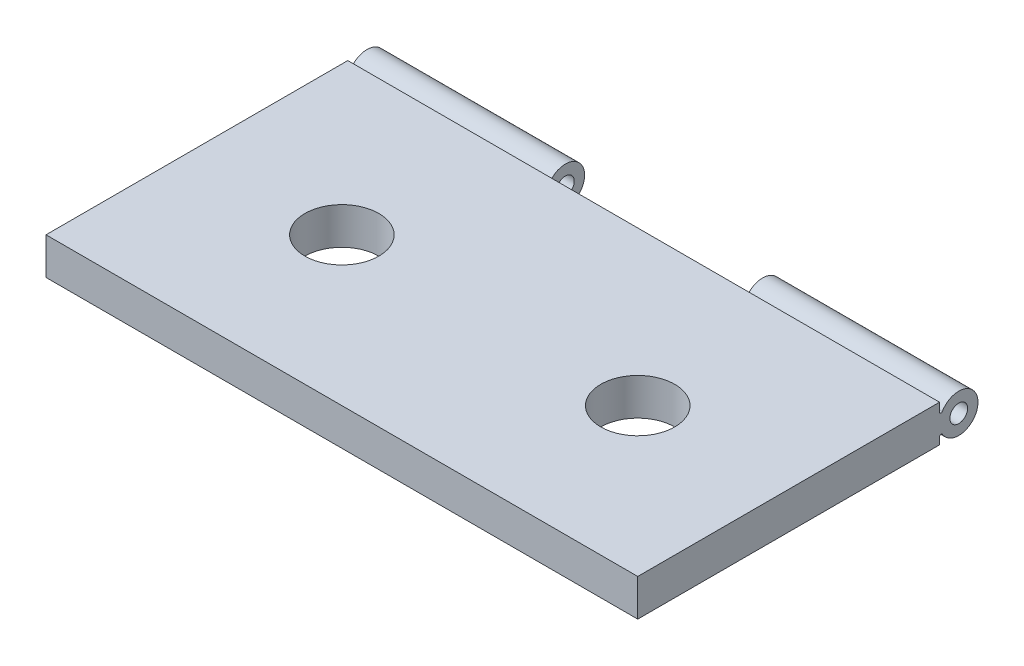
ISO-10303-21;
HEADER;
FILE_DESCRIPTION(('STEP AP214'),'2;1');
FILE_NAME('part.step','',(''),(''),'','','');
FILE_SCHEMA(('AUTOMOTIVE_DESIGN { 1 0 10303 214 1 1 1 1 }'));
ENDSEC;
DATA;
#1=APPLICATION_CONTEXT('core data for automotive mechanical design processes');
#2=APPLICATION_PROTOCOL_DEFINITION('international standard','automotive_design',2000,#1);
#3=PRODUCT_CONTEXT('',#1,'mechanical');
#4=PRODUCT('Part','Part','',(#3));
#5=PRODUCT_RELATED_PRODUCT_CATEGORY('part','',(#4));
#6=PRODUCT_DEFINITION_FORMATION('','',#4);
#7=PRODUCT_DEFINITION_CONTEXT('part definition',#1,'design');
#8=PRODUCT_DEFINITION('design','',#6,#7);
#9=PRODUCT_DEFINITION_SHAPE('','',#8);
#10=(LENGTH_UNIT() NAMED_UNIT(*) SI_UNIT(.MILLI.,.METRE.));
#11=(NAMED_UNIT(*) PLANE_ANGLE_UNIT() SI_UNIT($,.RADIAN.));
#12=(NAMED_UNIT(*) SI_UNIT($,.STERADIAN.) SOLID_ANGLE_UNIT());
#13=UNCERTAINTY_MEASURE_WITH_UNIT(LENGTH_MEASURE(1.E-05),#10,'distance_accuracy_value','');
#14=(GEOMETRIC_REPRESENTATION_CONTEXT(3) GLOBAL_UNCERTAINTY_ASSIGNED_CONTEXT((#13)) GLOBAL_UNIT_ASSIGNED_CONTEXT((#10,
#11,#12)) REPRESENTATION_CONTEXT('',''));
#15=CARTESIAN_POINT('',(0.,0.,0.));
#16=DIRECTION('',(0.,0.,1.));
#17=DIRECTION('',(1.,0.,0.));
#18=AXIS2_PLACEMENT_3D('',#15,#16,#17);
#19=CARTESIAN_POINT('',(-8.46666666666667,2.43749749874126,-13.335));
#20=DIRECTION('',(1.,0.,0.));
#21=DIRECTION('',(0.,0.,-1.));
#22=AXIS2_PLACEMENT_3D('',#19,#20,#21);
#23=CYLINDRICAL_SURFACE('',#22,0.127);
#24=DIRECTION('',(1.,0.,0.));
#25=VECTOR('',#24,1.);
#26=CARTESIAN_POINT('',(-8.46666666666667,2.43749749874126,-13.208));
#27=LINE('',#26,#25);
#28=CARTESIAN_POINT('',(-25.4,2.43749749874126,-13.208));
#29=VERTEX_POINT('',#28);
#30=CARTESIAN_POINT('',(-8.37061429648779,2.43749749874126,-13.208));
#31=VERTEX_POINT('',#30);
#32=EDGE_CURVE('E180',#29,#31,#27,.T.);
#33=ORIENTED_EDGE('',*,*,#32,.T.);
#34=CARTESIAN_POINT('',(-8.37061429648779,2.43749749874126,-13.335));
#35=DIRECTION('',(-1.,0.,0.));
#36=DIRECTION('',(0.,0.,1.));
#37=AXIS2_PLACEMENT_3D('',#34,#35,#36);
#38=CIRCLE('',#37,0.127);
#39=CARTESIAN_POINT('',(-8.37061429648779,2.37208249702927,-13.4438571428571));
#40=VERTEX_POINT('',#39);
#41=EDGE_CURVE('E129',#31,#40,#38,.F.);
#42=ORIENTED_EDGE('',*,*,#41,.T.);
#43=DIRECTION('',(1.,0.,0.));
#44=VECTOR('',#43,1.);
#45=CARTESIAN_POINT('',(-8.46666666666667,2.37208249702927,-13.4438571428571));
#46=LINE('',#45,#44);
#47=CARTESIAN_POINT('',(-25.4,2.37208249702927,-13.4438571428571));
#48=VERTEX_POINT('',#47);
#49=EDGE_CURVE('E176',#48,#40,#46,.T.);
#50=ORIENTED_EDGE('',*,*,#49,.F.);
#51=CARTESIAN_POINT('',(-25.4,2.43749749874126,-13.335));
#52=DIRECTION('',(-1.,0.,0.));
#53=DIRECTION('',(0.,0.,1.));
#54=AXIS2_PLACEMENT_3D('',#51,#52,#53);
#55=CIRCLE('',#54,0.127);
#56=EDGE_CURVE('E155',#48,#29,#55,.T.);
#57=ORIENTED_EDGE('',*,*,#56,.T.);
#58=EDGE_LOOP('',(#33,#42,#50,#57));
#59=FACE_BOUND('',#58,.T.);
#60=ADVANCED_FACE('F34',(#59),#23,.F.);
#61=CARTESIAN_POINT('',(-8.46666666666667,1.52168747477341,-14.859));
#62=DIRECTION('',(1.,0.,0.));
#63=DIRECTION('',(0.,0.,-1.));
#64=AXIS2_PLACEMENT_3D('',#61,#62,#63);
#65=CYLINDRICAL_SURFACE('',#64,1.651);
#66=ORIENTED_EDGE('',*,*,#49,.T.);
#67=CARTESIAN_POINT('',(-8.37061429648779,1.52168747477341,-14.859));
#68=DIRECTION('',(-1.,0.,0.));
#69=DIRECTION('',(0.,0.,1.));
#70=AXIS2_PLACEMENT_3D('',#67,#68,#69);
#71=CIRCLE('',#70,1.651);
#72=CARTESIAN_POINT('',(-8.37061429648779,0.671292452517549,-13.4438571428571));
#73=VERTEX_POINT('',#72);
#74=EDGE_CURVE('E126',#40,#73,#71,.T.);
#75=ORIENTED_EDGE('',*,*,#74,.T.);
#76=DIRECTION('',(1.,0.,0.));
#77=VECTOR('',#76,1.);
#78=CARTESIAN_POINT('',(-8.46666666666667,0.671292452517548,-13.4438571428571));
#79=LINE('',#78,#77);
#80=CARTESIAN_POINT('',(-25.4,0.671292452517549,-13.4438571428571));
#81=VERTEX_POINT('',#80);
#82=EDGE_CURVE('E172',#81,#73,#79,.T.);
#83=ORIENTED_EDGE('',*,*,#82,.F.);
#84=CARTESIAN_POINT('',(-25.4,1.52168747477341,-14.859));
#85=DIRECTION('',(-1.,0.,0.));
#86=DIRECTION('',(0.,0.,1.));
#87=AXIS2_PLACEMENT_3D('',#84,#85,#86);
#88=CIRCLE('',#87,1.651);
#89=EDGE_CURVE('E158',#81,#48,#88,.F.);
#90=ORIENTED_EDGE('',*,*,#89,.T.);
#91=EDGE_LOOP('',(#66,#75,#83,#90));
#92=FACE_BOUND('',#91,.T.);
#93=ADVANCED_FACE('F237',(#92),#65,.T.);
#94=CARTESIAN_POINT('',(-8.46666666666667,0.605877450805559,-13.335));
#95=DIRECTION('',(1.,0.,0.));
#96=DIRECTION('',(0.,0.,-1.));
#97=AXIS2_PLACEMENT_3D('',#94,#95,#96);
#98=CYLINDRICAL_SURFACE('',#97,0.127);
#99=ORIENTED_EDGE('',*,*,#82,.T.);
#100=CARTESIAN_POINT('',(-8.37061429648779,0.605877450805559,-13.335));
#101=DIRECTION('',(-1.,0.,0.));
#102=DIRECTION('',(0.,0.,1.));
#103=AXIS2_PLACEMENT_3D('',#100,#101,#102);
#104=CIRCLE('',#103,0.127);
#105=CARTESIAN_POINT('',(-8.37061429648779,0.605877450805557,-13.208));
#106=VERTEX_POINT('',#105);
#107=EDGE_CURVE('E123',#73,#106,#104,.F.);
#108=ORIENTED_EDGE('',*,*,#107,.T.);
#109=DIRECTION('',(1.,0.,0.));
#110=VECTOR('',#109,1.);
#111=CARTESIAN_POINT('',(-8.46666666666667,0.605877450805559,-13.208));
#112=LINE('',#111,#110);
#113=CARTESIAN_POINT('',(-25.4,0.605877450805559,-13.208));
#114=VERTEX_POINT('',#113);
#115=EDGE_CURVE('E168',#114,#106,#112,.T.);
#116=ORIENTED_EDGE('',*,*,#115,.F.);
#117=CARTESIAN_POINT('',(-25.4,0.605877450805559,-13.335));
#118=DIRECTION('',(-1.,0.,0.));
#119=DIRECTION('',(0.,0.,1.));
#120=AXIS2_PLACEMENT_3D('',#117,#118,#119);
#121=CIRCLE('',#120,0.127);
#122=EDGE_CURVE('E161',#114,#81,#121,.T.);
#123=ORIENTED_EDGE('',*,*,#122,.T.);
#124=EDGE_LOOP('',(#99,#108,#116,#123));
#125=FACE_BOUND('',#124,.T.);
#126=ADVANCED_FACE('F230',(#125),#98,.F.);
#127=CARTESIAN_POINT('',(-8.46666666666667,1.52168747477341,-14.859));
#128=DIRECTION('',(1.,0.,0.));
#129=DIRECTION('',(0.,0.,-1.));
#130=AXIS2_PLACEMENT_3D('',#127,#128,#129);
#131=CYLINDRICAL_SURFACE('',#130,0.762000000000001);
#132=CARTESIAN_POINT('',(-8.37061429648779,1.52168747477341,-14.859));
#133=DIRECTION('',(-1.,0.,0.));
#134=DIRECTION('',(0.,0.,1.));
#135=AXIS2_PLACEMENT_3D('',#132,#133,#134);
#136=CIRCLE('',#135,0.762000000000001);
#137=CARTESIAN_POINT('',(-8.37061429648779,1.52168747477341,-14.097));
#138=VERTEX_POINT('',#137);
#139=EDGE_CURVE('E38',#138,#138,#136,.T.);
#140=ORIENTED_EDGE('',*,*,#139,.F.);
#141=EDGE_LOOP('',(#140));
#142=FACE_BOUND('',#141,.T.);
#143=CARTESIAN_POINT('',(-25.4,1.52168747477341,-14.859));
#144=DIRECTION('',(-1.,0.,0.));
#145=DIRECTION('',(0.,0.,1.));
#146=AXIS2_PLACEMENT_3D('',#143,#144,#145);
#147=CIRCLE('',#146,0.762000000000001);
#148=CARTESIAN_POINT('',(-25.4,1.52168747477341,-14.097));
#149=VERTEX_POINT('',#148);
#150=EDGE_CURVE('E135',#149,#149,#147,.F.);
#151=ORIENTED_EDGE('',*,*,#150,.F.);
#152=EDGE_LOOP('',(#151));
#153=FACE_BOUND('',#152,.T.);
#154=ADVANCED_FACE('F268',(#142,#153),#131,.F.);
#155=CARTESIAN_POINT('',(-25.4,3.175,-12.7));
#156=DIRECTION('',(0.,1.,0.));
#157=DIRECTION('',(0.,0.,1.));
#158=AXIS2_PLACEMENT_3D('',#155,#156,#157);
#159=PLANE('',#158);
#160=DIRECTION('',(1.,0.,0.));
#161=VECTOR('',#160,1.);
#162=CARTESIAN_POINT('',(-8.46666666666667,3.175,-13.208));
#163=LINE('',#162,#161);
#164=CARTESIAN_POINT('',(-25.4,3.175,-13.208));
#165=VERTEX_POINT('',#164);
#166=CARTESIAN_POINT('',(25.4,3.175,-13.208));
#167=VERTEX_POINT('',#166);
#168=EDGE_CURVE('E183',#165,#167,#163,.T.);
#169=ORIENTED_EDGE('',*,*,#168,.F.);
#170=DIRECTION('',(0.,0.,1.));
#171=VECTOR('',#170,1.);
#172=CARTESIAN_POINT('',(-25.4,3.175,12.7));
#173=LINE('',#172,#171);
#174=CARTESIAN_POINT('',(-25.4,3.175,12.7));
#175=VERTEX_POINT('',#174);
#176=EDGE_CURVE('E98',#165,#175,#173,.T.);
#177=ORIENTED_EDGE('',*,*,#176,.T.);
#178=DIRECTION('',(1.,0.,0.));
#179=VECTOR('',#178,1.);
#180=CARTESIAN_POINT('',(25.4,3.175,12.7));
#181=LINE('',#180,#179);
#182=CARTESIAN_POINT('',(25.4,3.175,12.7));
#183=VERTEX_POINT('',#182);
#184=EDGE_CURVE('E60',#175,#183,#181,.T.);
#185=ORIENTED_EDGE('',*,*,#184,.T.);
#186=DIRECTION('',(0.,0.,-1.));
#187=VECTOR('',#186,1.);
#188=CARTESIAN_POINT('',(25.4,3.175,12.7));
#189=LINE('',#188,#187);
#190=EDGE_CURVE('E91',#183,#167,#189,.T.);
#191=ORIENTED_EDGE('',*,*,#190,.T.);
#192=EDGE_LOOP('',(#169,#177,#185,#191));
#193=FACE_BOUND('',#192,.T.);
#194=CARTESIAN_POINT('',(-12.7,3.175,0.));
#195=DIRECTION('',(0.,1.,0.));
#196=DIRECTION('',(0.,0.,1.));
#197=AXIS2_PLACEMENT_3D('',#194,#195,#196);
#198=CIRCLE('',#197,3.175);
#199=CARTESIAN_POINT('',(-12.7,3.175,3.175));
#200=VERTEX_POINT('',#199);
#201=EDGE_CURVE('E193',#200,#200,#198,.T.);
#202=ORIENTED_EDGE('',*,*,#201,.F.);
#203=EDGE_LOOP('',(#202));
#204=FACE_BOUND('',#203,.T.);
#205=CARTESIAN_POINT('',(12.7,3.175,0.));
#206=DIRECTION('',(0.,1.,0.));
#207=DIRECTION('',(0.,0.,1.));
#208=AXIS2_PLACEMENT_3D('',#205,#206,#207);
#209=CIRCLE('',#208,3.175);
#210=CARTESIAN_POINT('',(12.7,3.175,3.175));
#211=VERTEX_POINT('',#210);
#212=EDGE_CURVE('E187',#211,#211,#209,.T.);
#213=ORIENTED_EDGE('',*,*,#212,.F.);
#214=EDGE_LOOP('',(#213));
#215=FACE_BOUND('',#214,.T.);
#216=ADVANCED_FACE('F265',(#193,#204,#215),#159,.T.);
#217=CARTESIAN_POINT('',(-25.4,0.,-12.7));
#218=DIRECTION('',(0.,1.,0.));
#219=DIRECTION('',(0.,0.,1.));
#220=AXIS2_PLACEMENT_3D('',#217,#218,#219);
#221=PLANE('',#220);
#222=DIRECTION('',(0.,0.,1.));
#223=VECTOR('',#222,1.);
#224=CARTESIAN_POINT('',(-25.4,0.,12.7));
#225=LINE('',#224,#223);
#226=CARTESIAN_POINT('',(-25.4,0.,-13.208));
#227=VERTEX_POINT('',#226);
#228=CARTESIAN_POINT('',(-25.4,0.,12.7));
#229=VERTEX_POINT('',#228);
#230=EDGE_CURVE('E81',#227,#229,#225,.T.);
#231=ORIENTED_EDGE('',*,*,#230,.F.);
#232=DIRECTION('',(1.,0.,0.));
#233=VECTOR('',#232,1.);
#234=CARTESIAN_POINT('',(-8.46666666666667,0.,-13.208));
#235=LINE('',#234,#233);
#236=CARTESIAN_POINT('',(25.4,0.,-13.208));
#237=VERTEX_POINT('',#236);
#238=EDGE_CURVE('E97',#227,#237,#235,.T.);
#239=ORIENTED_EDGE('',*,*,#238,.T.);
#240=DIRECTION('',(0.,0.,-1.));
#241=VECTOR('',#240,1.);
#242=CARTESIAN_POINT('',(25.4,0.,12.7));
#243=LINE('',#242,#241);
#244=CARTESIAN_POINT('',(25.4,0.,12.7));
#245=VERTEX_POINT('',#244);
#246=EDGE_CURVE('E80',#245,#237,#243,.T.);
#247=ORIENTED_EDGE('',*,*,#246,.F.);
#248=DIRECTION('',(1.,0.,0.));
#249=VECTOR('',#248,1.);
#250=CARTESIAN_POINT('',(25.4,0.,12.7));
#251=LINE('',#250,#249);
#252=EDGE_CURVE('E71',#229,#245,#251,.T.);
#253=ORIENTED_EDGE('',*,*,#252,.F.);
#254=EDGE_LOOP('',(#231,#239,#247,#253));
#255=FACE_BOUND('',#254,.T.);
#256=CARTESIAN_POINT('',(-12.7,0.,0.));
#257=DIRECTION('',(0.,1.,0.));
#258=DIRECTION('',(0.,0.,1.));
#259=AXIS2_PLACEMENT_3D('',#256,#257,#258);
#260=CIRCLE('',#259,3.175);
#261=CARTESIAN_POINT('',(-12.7,0.,3.175));
#262=VERTEX_POINT('',#261);
#263=EDGE_CURVE('E190',#262,#262,#260,.T.);
#264=ORIENTED_EDGE('',*,*,#263,.T.);
#265=EDGE_LOOP('',(#264));
#266=FACE_BOUND('',#265,.T.);
#267=CARTESIAN_POINT('',(12.7,0.,0.));
#268=DIRECTION('',(0.,1.,0.));
#269=DIRECTION('',(0.,0.,1.));
#270=AXIS2_PLACEMENT_3D('',#267,#268,#269);
#271=CIRCLE('',#270,3.175);
#272=CARTESIAN_POINT('',(12.7,0.,3.175));
#273=VERTEX_POINT('',#272);
#274=EDGE_CURVE('E186',#273,#273,#271,.T.);
#275=ORIENTED_EDGE('',*,*,#274,.T.);
#276=EDGE_LOOP('',(#275));
#277=FACE_BOUND('',#276,.T.);
#278=ADVANCED_FACE('F94',(#255,#266,#277),#221,.F.);
#279=CARTESIAN_POINT('',(-25.4,3.175,12.7));
#280=DIRECTION('',(1.,0.,0.));
#281=DIRECTION('',(0.,0.,-1.));
#282=AXIS2_PLACEMENT_3D('',#279,#280,#281);
#283=PLANE('',#282);
#284=ORIENTED_EDGE('',*,*,#230,.T.);
#285=DIRECTION('',(0.,-1.,0.));
#286=VECTOR('',#285,1.);
#287=CARTESIAN_POINT('',(-25.4,3.175,12.7));
#288=LINE('',#287,#286);
#289=EDGE_CURVE('E12',#175,#229,#288,.T.);
#290=ORIENTED_EDGE('',*,*,#289,.F.);
#291=ORIENTED_EDGE('',*,*,#176,.F.);
#292=DIRECTION('',(0.,1.,0.));
#293=VECTOR('',#292,1.);
#294=CARTESIAN_POINT('',(-25.4,3.175,-13.208));
#295=LINE('',#294,#293);
#296=EDGE_CURVE('E132',#29,#165,#295,.T.);
#297=ORIENTED_EDGE('',*,*,#296,.F.);
#298=ORIENTED_EDGE('',*,*,#56,.F.);
#299=ORIENTED_EDGE('',*,*,#89,.F.);
#300=ORIENTED_EDGE('',*,*,#122,.F.);
#301=DIRECTION('',(0.,1.,0.));
#302=VECTOR('',#301,1.);
#303=CARTESIAN_POINT('',(-25.4,0.605877450805559,-13.208));
#304=LINE('',#303,#302);
#305=EDGE_CURVE('E150',#227,#114,#304,.T.);
#306=ORIENTED_EDGE('',*,*,#305,.F.);
#307=EDGE_LOOP('',(#284,#290,#291,#297,#298,#299,#300,#306));
#308=FACE_BOUND('',#307,.T.);
#309=ORIENTED_EDGE('',*,*,#150,.T.);
#310=EDGE_LOOP('',(#309));
#311=FACE_BOUND('',#310,.T.);
#312=ADVANCED_FACE('F36',(#308,#311),#283,.F.);
#313=CARTESIAN_POINT('',(25.4,3.175,12.7));
#314=DIRECTION('',(0.,0.,-1.));
#315=DIRECTION('',(-1.,0.,0.));
#316=AXIS2_PLACEMENT_3D('',#313,#314,#315);
#317=PLANE('',#316);
#318=ORIENTED_EDGE('',*,*,#252,.T.);
#319=DIRECTION('',(0.,-1.,0.));
#320=VECTOR('',#319,1.);
#321=CARTESIAN_POINT('',(25.4,3.175,12.7));
#322=LINE('',#321,#320);
#323=EDGE_CURVE('E43',#183,#245,#322,.T.);
#324=ORIENTED_EDGE('',*,*,#323,.F.);
#325=ORIENTED_EDGE('',*,*,#184,.F.);
#326=ORIENTED_EDGE('',*,*,#289,.T.);
#327=EDGE_LOOP('',(#318,#324,#325,#326));
#328=FACE_BOUND('',#327,.T.);
#329=ADVANCED_FACE('F73',(#328),#317,.F.);
#330=CARTESIAN_POINT('',(25.4,3.175,12.7));
#331=DIRECTION('',(-1.,0.,0.));
#332=DIRECTION('',(0.,0.,1.));
#333=AXIS2_PLACEMENT_3D('',#330,#331,#332);
#334=PLANE('',#333);
#335=ORIENTED_EDGE('',*,*,#246,.T.);
#336=DIRECTION('',(0.,1.,0.));
#337=VECTOR('',#336,1.);
#338=CARTESIAN_POINT('',(25.4,0.605877450805559,-13.208));
#339=LINE('',#338,#337);
#340=CARTESIAN_POINT('',(25.4,0.605877450805559,-13.208));
#341=VERTEX_POINT('',#340);
#342=EDGE_CURVE('E145',#237,#341,#339,.T.);
#343=ORIENTED_EDGE('',*,*,#342,.T.);
#344=CARTESIAN_POINT('',(25.4,0.605877450805559,-13.335));
#345=DIRECTION('',(-1.,0.,0.));
#346=DIRECTION('',(0.,0.,-1.));
#347=AXIS2_PLACEMENT_3D('',#344,#345,#346);
#348=CIRCLE('',#347,0.127);
#349=CARTESIAN_POINT('',(25.4,0.671292452517549,-13.4438571428571));
#350=VERTEX_POINT('',#349);
#351=EDGE_CURVE('E142',#341,#350,#348,.T.);
#352=ORIENTED_EDGE('',*,*,#351,.T.);
#353=CARTESIAN_POINT('',(25.4,1.52168747477341,-14.859));
#354=DIRECTION('',(1.,0.,0.));
#355=DIRECTION('',(0.,0.,-1.));
#356=AXIS2_PLACEMENT_3D('',#353,#354,#355);
#357=CIRCLE('',#356,1.651);
#358=CARTESIAN_POINT('',(25.4,2.37208249702927,-13.4438571428571));
#359=VERTEX_POINT('',#358);
#360=EDGE_CURVE('E139',#350,#359,#357,.T.);
#361=ORIENTED_EDGE('',*,*,#360,.T.);
#362=CARTESIAN_POINT('',(25.4,2.43749749874126,-13.335));
#363=DIRECTION('',(-1.,0.,0.));
#364=DIRECTION('',(0.,0.,-1.));
#365=AXIS2_PLACEMENT_3D('',#362,#363,#364);
#366=CIRCLE('',#365,0.127);
#367=CARTESIAN_POINT('',(25.4,2.43749749874126,-13.208));
#368=VERTEX_POINT('',#367);
#369=EDGE_CURVE('E136',#359,#368,#366,.T.);
#370=ORIENTED_EDGE('',*,*,#369,.T.);
#371=DIRECTION('',(0.,1.,0.));
#372=VECTOR('',#371,1.);
#373=CARTESIAN_POINT('',(25.4,3.175,-13.208));
#374=LINE('',#373,#372);
#375=EDGE_CURVE('E133',#368,#167,#374,.T.);
#376=ORIENTED_EDGE('',*,*,#375,.T.);
#377=ORIENTED_EDGE('',*,*,#190,.F.);
#378=ORIENTED_EDGE('',*,*,#323,.T.);
#379=EDGE_LOOP('',(#335,#343,#352,#361,#370,#376,#377,#378));
#380=FACE_BOUND('',#379,.T.);
#381=CARTESIAN_POINT('',(25.4,1.52168747477341,-14.859));
#382=DIRECTION('',(1.,0.,0.));
#383=DIRECTION('',(0.,0.,-1.));
#384=AXIS2_PLACEMENT_3D('',#381,#382,#383);
#385=CIRCLE('',#384,0.762000000000001);
#386=CARTESIAN_POINT('',(25.4,1.52168747477341,-15.621));
#387=VERTEX_POINT('',#386);
#388=EDGE_CURVE('E147',#387,#387,#385,.T.);
#389=ORIENTED_EDGE('',*,*,#388,.F.);
#390=EDGE_LOOP('',(#389));
#391=FACE_BOUND('',#390,.T.);
#392=ADVANCED_FACE('F85',(#380,#391),#334,.F.);
#393=CARTESIAN_POINT('',(-12.7,3.175,0.));
#394=DIRECTION('',(0.,-1.,0.));
#395=DIRECTION('',(0.,0.,-1.));
#396=AXIS2_PLACEMENT_3D('',#393,#394,#395);
#397=CYLINDRICAL_SURFACE('',#396,3.175);
#398=ORIENTED_EDGE('',*,*,#201,.T.);
#399=EDGE_LOOP('',(#398));
#400=FACE_BOUND('',#399,.T.);
#401=ORIENTED_EDGE('',*,*,#263,.F.);
#402=EDGE_LOOP('',(#401));
#403=FACE_BOUND('',#402,.T.);
#404=ADVANCED_FACE('F277',(#400,#403),#397,.F.);
#405=CARTESIAN_POINT('',(12.7,3.175,0.));
#406=DIRECTION('',(0.,-1.,0.));
#407=DIRECTION('',(0.,0.,-1.));
#408=AXIS2_PLACEMENT_3D('',#405,#406,#407);
#409=CYLINDRICAL_SURFACE('',#408,3.175);
#410=ORIENTED_EDGE('',*,*,#212,.T.);
#411=EDGE_LOOP('',(#410));
#412=FACE_BOUND('',#411,.T.);
#413=ORIENTED_EDGE('',*,*,#274,.F.);
#414=EDGE_LOOP('',(#413));
#415=FACE_BOUND('',#414,.T.);
#416=ADVANCED_FACE('F274',(#412,#415),#409,.F.);
#417=CARTESIAN_POINT('',(-8.46666666666667,3.175,-13.208));
#418=DIRECTION('',(0.,0.,1.));
#419=DIRECTION('',(1.,0.,0.));
#420=AXIS2_PLACEMENT_3D('',#417,#418,#419);
#421=PLANE('',#420);
#422=CARTESIAN_POINT('',(8.56271903684554,2.43749749874126,-13.208));
#423=VERTEX_POINT('',#422);
#424=EDGE_CURVE('E179',#423,#368,#27,.T.);
#425=ORIENTED_EDGE('',*,*,#424,.F.);
#426=DIRECTION('',(0.,1.,0.));
#427=VECTOR('',#426,1.);
#428=CARTESIAN_POINT('',(8.56271903684554,-22.225,-13.208));
#429=LINE('',#428,#427);
#430=CARTESIAN_POINT('',(8.56271903684554,0.605877450805559,-13.208));
#431=VERTEX_POINT('',#430);
#432=EDGE_CURVE('E51',#431,#423,#429,.T.);
#433=ORIENTED_EDGE('',*,*,#432,.F.);
#434=EDGE_CURVE('E167',#431,#341,#112,.T.);
#435=ORIENTED_EDGE('',*,*,#434,.T.);
#436=ORIENTED_EDGE('',*,*,#342,.F.);
#437=ORIENTED_EDGE('',*,*,#238,.F.);
#438=ORIENTED_EDGE('',*,*,#305,.T.);
#439=ORIENTED_EDGE('',*,*,#115,.T.);
#440=DIRECTION('',(0.,1.,0.));
#441=VECTOR('',#440,1.);
#442=CARTESIAN_POINT('',(-8.37061429648779,-22.225,-13.208));
#443=LINE('',#442,#441);
#444=EDGE_CURVE('E110',#106,#31,#443,.T.);
#445=ORIENTED_EDGE('',*,*,#444,.T.);
#446=ORIENTED_EDGE('',*,*,#32,.F.);
#447=ORIENTED_EDGE('',*,*,#296,.T.);
#448=ORIENTED_EDGE('',*,*,#168,.T.);
#449=ORIENTED_EDGE('',*,*,#375,.F.);
#450=EDGE_LOOP('',(#425,#433,#435,#436,#437,#438,#439,#445,#446,#447,#448,#449));
#451=FACE_BOUND('',#450,.T.);
#452=ADVANCED_FACE('F206',(#451),#421,.F.);
#453=CARTESIAN_POINT('',(8.56271903684554,2.37208249702927,-13.4438571428571));
#454=VERTEX_POINT('',#453);
#455=EDGE_CURVE('E175',#454,#359,#46,.T.);
#456=ORIENTED_EDGE('',*,*,#455,.F.);
#457=CARTESIAN_POINT('',(8.56271903684554,2.43749749874126,-13.335));
#458=DIRECTION('',(1.,0.,0.));
#459=DIRECTION('',(0.,0.,-1.));
#460=AXIS2_PLACEMENT_3D('',#457,#458,#459);
#461=CIRCLE('',#460,0.127);
#462=EDGE_CURVE('E121',#454,#423,#461,.F.);
#463=ORIENTED_EDGE('',*,*,#462,.T.);
#464=ORIENTED_EDGE('',*,*,#424,.T.);
#465=ORIENTED_EDGE('',*,*,#369,.F.);
#466=EDGE_LOOP('',(#456,#463,#464,#465));
#467=FACE_BOUND('',#466,.T.);
#468=ADVANCED_FACE('F262',(#467),#23,.F.);
#469=CARTESIAN_POINT('',(8.56271903684554,0.671292452517549,-13.4438571428571));
#470=VERTEX_POINT('',#469);
#471=EDGE_CURVE('E171',#470,#350,#79,.T.);
#472=ORIENTED_EDGE('',*,*,#471,.F.);
#473=CARTESIAN_POINT('',(8.56271903684554,1.52168747477341,-14.859));
#474=DIRECTION('',(1.,0.,0.));
#475=DIRECTION('',(0.,0.,-1.));
#476=AXIS2_PLACEMENT_3D('',#473,#474,#475);
#477=CIRCLE('',#476,1.651);
#478=EDGE_CURVE('E108',#470,#454,#477,.T.);
#479=ORIENTED_EDGE('',*,*,#478,.T.);
#480=ORIENTED_EDGE('',*,*,#455,.T.);
#481=ORIENTED_EDGE('',*,*,#360,.F.);
#482=EDGE_LOOP('',(#472,#479,#480,#481));
#483=FACE_BOUND('',#482,.T.);
#484=ADVANCED_FACE('F258',(#483),#65,.T.);
#485=ORIENTED_EDGE('',*,*,#434,.F.);
#486=CARTESIAN_POINT('',(8.56271903684554,0.605877450805559,-13.335));
#487=DIRECTION('',(1.,0.,0.));
#488=DIRECTION('',(0.,0.,-1.));
#489=AXIS2_PLACEMENT_3D('',#486,#487,#488);
#490=CIRCLE('',#489,0.127);
#491=EDGE_CURVE('E104',#431,#470,#490,.F.);
#492=ORIENTED_EDGE('',*,*,#491,.T.);
#493=ORIENTED_EDGE('',*,*,#471,.T.);
#494=ORIENTED_EDGE('',*,*,#351,.F.);
#495=EDGE_LOOP('',(#485,#492,#493,#494));
#496=FACE_BOUND('',#495,.T.);
#497=ADVANCED_FACE('F300',(#496),#98,.F.);
#498=CARTESIAN_POINT('',(8.56271903684554,1.52168747477341,-14.859));
#499=DIRECTION('',(1.,0.,0.));
#500=DIRECTION('',(0.,0.,-1.));
#501=AXIS2_PLACEMENT_3D('',#498,#499,#500);
#502=CIRCLE('',#501,0.762000000000001);
#503=CARTESIAN_POINT('',(8.56271903684554,1.52168747477341,-15.621));
#504=VERTEX_POINT('',#503);
#505=EDGE_CURVE('E102',#504,#504,#502,.T.);
#506=ORIENTED_EDGE('',*,*,#505,.F.);
#507=EDGE_LOOP('',(#506));
#508=FACE_BOUND('',#507,.T.);
#509=ORIENTED_EDGE('',*,*,#388,.T.);
#510=EDGE_LOOP('',(#509));
#511=FACE_BOUND('',#510,.T.);
#512=ADVANCED_FACE('F364',(#508,#511),#131,.F.);
#513=CARTESIAN_POINT('',(-8.37061429648779,-22.225,-13.208));
#514=DIRECTION('',(-1.,0.,0.));
#515=DIRECTION('',(0.,0.,1.));
#516=AXIS2_PLACEMENT_3D('',#513,#514,#515);
#517=PLANE('',#516);
#518=ORIENTED_EDGE('',*,*,#139,.T.);
#519=EDGE_LOOP('',(#518));
#520=FACE_BOUND('',#519,.T.);
#521=ORIENTED_EDGE('',*,*,#444,.F.);
#522=ORIENTED_EDGE('',*,*,#107,.F.);
#523=ORIENTED_EDGE('',*,*,#74,.F.);
#524=ORIENTED_EDGE('',*,*,#41,.F.);
#525=EDGE_LOOP('',(#521,#522,#523,#524));
#526=FACE_BOUND('',#525,.T.);
#527=ADVANCED_FACE('F412',(#520,#526),#517,.F.);
#528=CARTESIAN_POINT('',(8.56271903684554,-22.225,-13.208));
#529=DIRECTION('',(1.,0.,0.));
#530=DIRECTION('',(0.,0.,-1.));
#531=AXIS2_PLACEMENT_3D('',#528,#529,#530);
#532=PLANE('',#531);
#533=ORIENTED_EDGE('',*,*,#505,.T.);
#534=EDGE_LOOP('',(#533));
#535=FACE_BOUND('',#534,.T.);
#536=ORIENTED_EDGE('',*,*,#478,.F.);
#537=ORIENTED_EDGE('',*,*,#491,.F.);
#538=ORIENTED_EDGE('',*,*,#432,.T.);
#539=ORIENTED_EDGE('',*,*,#462,.F.);
#540=EDGE_LOOP('',(#536,#537,#538,#539));
#541=FACE_BOUND('',#540,.T.);
#542=ADVANCED_FACE('F420',(#535,#541),#532,.F.);
#543=CLOSED_SHELL('',(#60,#93,#126,#154,#216,#278,#312,#329,#392,#404,#416,#452,#468,#484,#497,
#512,#527,#542));
#544=MANIFOLD_SOLID_BREP('B2',#543);
#545=ADVANCED_BREP_SHAPE_REPRESENTATION('',(#18,#544),#14);
#546=SHAPE_DEFINITION_REPRESENTATION(#9,#545);
ENDSEC;
END-ISO-10303-21;
